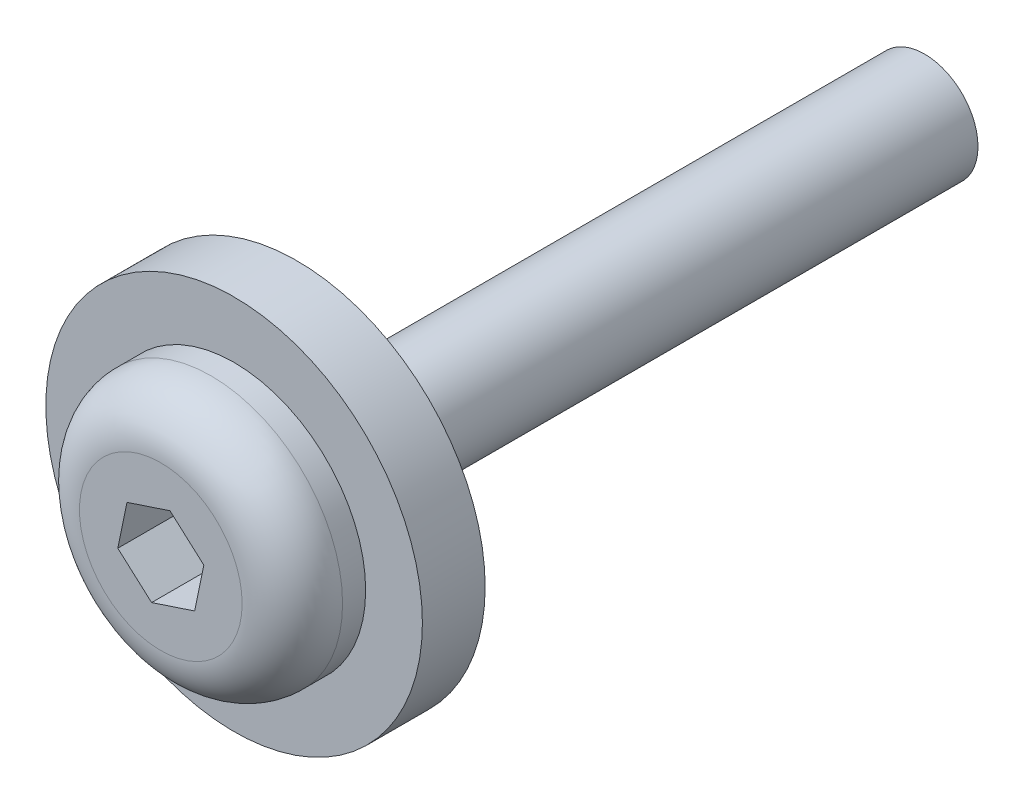
ISO-10303-21;
HEADER;
FILE_DESCRIPTION(('STEP AP214'),'2;1');
FILE_NAME('part.step','',(''),(''),'','','');
FILE_SCHEMA(('AUTOMOTIVE_DESIGN { 1 0 10303 214 1 1 1 1 }'));
ENDSEC;
DATA;
#1=APPLICATION_CONTEXT('core data for automotive mechanical design processes');
#2=APPLICATION_PROTOCOL_DEFINITION('international standard','automotive_design',2000,#1);
#3=PRODUCT_CONTEXT('',#1,'mechanical');
#4=PRODUCT('Part','Part','',(#3));
#5=PRODUCT_RELATED_PRODUCT_CATEGORY('part','',(#4));
#6=PRODUCT_DEFINITION_FORMATION('','',#4);
#7=PRODUCT_DEFINITION_CONTEXT('part definition',#1,'design');
#8=PRODUCT_DEFINITION('design','',#6,#7);
#9=PRODUCT_DEFINITION_SHAPE('','',#8);
#10=(LENGTH_UNIT() NAMED_UNIT(*) SI_UNIT(.MILLI.,.METRE.));
#11=(NAMED_UNIT(*) PLANE_ANGLE_UNIT() SI_UNIT($,.RADIAN.));
#12=(NAMED_UNIT(*) SI_UNIT($,.STERADIAN.) SOLID_ANGLE_UNIT());
#13=UNCERTAINTY_MEASURE_WITH_UNIT(LENGTH_MEASURE(1.E-05),#10,'distance_accuracy_value','');
#14=(GEOMETRIC_REPRESENTATION_CONTEXT(3) GLOBAL_UNCERTAINTY_ASSIGNED_CONTEXT((#13)) GLOBAL_UNIT_ASSIGNED_CONTEXT((#10,
#11,#12)) REPRESENTATION_CONTEXT('',''));
#15=CARTESIAN_POINT('',(0.,0.,0.));
#16=DIRECTION('',(0.,0.,1.));
#17=DIRECTION('',(1.,0.,0.));
#18=AXIS2_PLACEMENT_3D('',#15,#16,#17);
#19=CARTESIAN_POINT('',(0.,0.,15.875));
#20=DIRECTION('',(0.,0.,-1.));
#21=DIRECTION('',(-1.,0.,0.));
#22=AXIS2_PLACEMENT_3D('',#19,#20,#21);
#23=CYLINDRICAL_SURFACE('',#22,1.35255);
#24=CARTESIAN_POINT('',(0.,0.,15.875));
#25=DIRECTION('',(0.,0.,1.));
#26=DIRECTION('',(1.,0.,0.));
#27=AXIS2_PLACEMENT_3D('',#24,#25,#26);
#28=CIRCLE('',#27,1.35255);
#29=CARTESIAN_POINT('',(1.35255,0.,15.875));
#30=VERTEX_POINT('',#29);
#31=EDGE_CURVE('E150',#30,#30,#28,.T.);
#32=ORIENTED_EDGE('',*,*,#31,.F.);
#33=EDGE_LOOP('',(#32));
#34=FACE_BOUND('',#33,.T.);
#35=CARTESIAN_POINT('',(0.,0.,0.));
#36=DIRECTION('',(0.,0.,1.));
#37=DIRECTION('',(1.,0.,0.));
#38=AXIS2_PLACEMENT_3D('',#35,#36,#37);
#39=CIRCLE('',#38,1.35255);
#40=CARTESIAN_POINT('',(1.35255,0.,0.));
#41=VERTEX_POINT('',#40);
#42=EDGE_CURVE('E154',#41,#41,#39,.T.);
#43=ORIENTED_EDGE('',*,*,#42,.T.);
#44=EDGE_LOOP('',(#43));
#45=FACE_BOUND('',#44,.T.);
#46=ADVANCED_FACE('F39',(#34,#45),#23,.T.);
#47=CARTESIAN_POINT('',(0.,0.,0.));
#48=DIRECTION('',(0.,0.,1.));
#49=DIRECTION('',(1.,0.,0.));
#50=AXIS2_PLACEMENT_3D('',#47,#48,#49);
#51=PLANE('',#50);
#52=ORIENTED_EDGE('',*,*,#42,.F.);
#53=EDGE_LOOP('',(#52));
#54=FACE_BOUND('',#53,.T.);
#55=ADVANCED_FACE('F179',(#54),#51,.F.);
#56=CARTESIAN_POINT('',(0.,0.,17.4625));
#57=DIRECTION('',(0.,0.,-1.));
#58=DIRECTION('',(-1.,0.,0.));
#59=AXIS2_PLACEMENT_3D('',#56,#57,#58);
#60=CYLINDRICAL_SURFACE('',#59,4.7625);
#61=CARTESIAN_POINT('',(0.,0.,17.4625));
#62=DIRECTION('',(0.,0.,1.));
#63=DIRECTION('',(1.,0.,0.));
#64=AXIS2_PLACEMENT_3D('',#61,#62,#63);
#65=CIRCLE('',#64,4.7625);
#66=CARTESIAN_POINT('',(4.7625,0.,17.4625));
#67=VERTEX_POINT('',#66);
#68=EDGE_CURVE('E151',#67,#67,#65,.T.);
#69=ORIENTED_EDGE('',*,*,#68,.F.);
#70=EDGE_LOOP('',(#69));
#71=FACE_BOUND('',#70,.T.);
#72=CARTESIAN_POINT('',(0.,0.,15.875));
#73=DIRECTION('',(0.,0.,1.));
#74=DIRECTION('',(1.,0.,0.));
#75=AXIS2_PLACEMENT_3D('',#72,#73,#74);
#76=CIRCLE('',#75,4.7625);
#77=CARTESIAN_POINT('',(4.7625,0.,15.875));
#78=VERTEX_POINT('',#77);
#79=EDGE_CURVE('E141',#78,#78,#76,.T.);
#80=ORIENTED_EDGE('',*,*,#79,.T.);
#81=EDGE_LOOP('',(#80));
#82=FACE_BOUND('',#81,.T.);
#83=ADVANCED_FACE('F184',(#71,#82),#60,.T.);
#84=CARTESIAN_POINT('',(0.,0.,17.4625));
#85=DIRECTION('',(0.,0.,1.));
#86=DIRECTION('',(1.,0.,0.));
#87=AXIS2_PLACEMENT_3D('',#84,#85,#86);
#88=PLANE('',#87);
#89=CARTESIAN_POINT('',(0.,0.,17.4625));
#90=DIRECTION('',(0.,0.,1.));
#91=DIRECTION('',(1.,0.,0.));
#92=AXIS2_PLACEMENT_3D('',#89,#90,#91);
#93=CIRCLE('',#92,3.3274);
#94=CARTESIAN_POINT('',(3.3274,0.,17.4625));
#95=VERTEX_POINT('',#94);
#96=EDGE_CURVE('E147',#95,#95,#93,.T.);
#97=ORIENTED_EDGE('',*,*,#96,.F.);
#98=EDGE_LOOP('',(#97));
#99=FACE_BOUND('',#98,.T.);
#100=ORIENTED_EDGE('',*,*,#68,.T.);
#101=EDGE_LOOP('',(#100));
#102=FACE_BOUND('',#101,.T.);
#103=ADVANCED_FACE('F192',(#99,#102),#88,.T.);
#104=CARTESIAN_POINT('',(0.,0.,15.875));
#105=DIRECTION('',(0.,0.,1.));
#106=DIRECTION('',(1.,0.,0.));
#107=AXIS2_PLACEMENT_3D('',#104,#105,#106);
#108=PLANE('',#107);
#109=ORIENTED_EDGE('',*,*,#31,.T.);
#110=EDGE_LOOP('',(#109));
#111=FACE_BOUND('',#110,.T.);
#112=ORIENTED_EDGE('',*,*,#79,.F.);
#113=EDGE_LOOP('',(#112));
#114=FACE_BOUND('',#113,.T.);
#115=ADVANCED_FACE('F194',(#111,#114),#108,.F.);
#116=CARTESIAN_POINT('',(0.,0.,19.3167));
#117=DIRECTION('',(0.,0.,-1.));
#118=DIRECTION('',(-1.,0.,0.));
#119=AXIS2_PLACEMENT_3D('',#116,#117,#118);
#120=CYLINDRICAL_SURFACE('',#119,3.3274);
#121=CARTESIAN_POINT('',(0.,0.,18.0467));
#122=DIRECTION('',(0.,0.,1.));
#123=DIRECTION('',(1.,0.,0.));
#124=AXIS2_PLACEMENT_3D('',#121,#122,#123);
#125=CIRCLE('',#124,3.3274);
#126=CARTESIAN_POINT('',(3.3274,0.,18.0467));
#127=VERTEX_POINT('',#126);
#128=EDGE_CURVE('E11',#127,#127,#125,.F.);
#129=ORIENTED_EDGE('',*,*,#128,.T.);
#130=EDGE_LOOP('',(#129));
#131=FACE_BOUND('',#130,.T.);
#132=ORIENTED_EDGE('',*,*,#96,.T.);
#133=EDGE_LOOP('',(#132));
#134=FACE_BOUND('',#133,.T.);
#135=ADVANCED_FACE('F174',(#131,#134),#120,.T.);
#136=CARTESIAN_POINT('',(0.,0.,19.3167));
#137=DIRECTION('',(0.,0.,1.));
#138=DIRECTION('',(1.,0.,0.));
#139=AXIS2_PLACEMENT_3D('',#136,#137,#138);
#140=PLANE('',#139);
#141=DIRECTION('',(0.202959735100038,0.979187084232693,0.));
#142=VECTOR('',#141,1.);
#143=CARTESIAN_POINT('',(0.855273787268202,-0.76229136753622,19.3167));
#144=LINE('',#143,#142);
#145=CARTESIAN_POINT('',(0.855273787268202,-0.76229136753622,19.3167));
#146=VERTEX_POINT('',#145);
#147=CARTESIAN_POINT('',(1.08780058300605,0.359543143197081,19.3167));
#148=VERTEX_POINT('',#147);
#149=EDGE_CURVE('E54',#146,#148,#144,.T.);
#150=ORIENTED_EDGE('',*,*,#149,.F.);
#151=DIRECTION('',(0.949480757553144,0.313825255574353,0.));
#152=VECTOR('',#151,1.);
#153=CARTESIAN_POINT('',(-0.232526795737845,-1.1218345107333,19.3167));
#154=LINE('',#153,#152);
#155=CARTESIAN_POINT('',(-0.232526795737845,-1.1218345107333,19.3167));
#156=VERTEX_POINT('',#155);
#157=EDGE_CURVE('E137',#156,#146,#154,.T.);
#158=ORIENTED_EDGE('',*,*,#157,.F.);
#159=DIRECTION('',(0.746521022453106,-0.66536182865834,0.));
#160=VECTOR('',#159,1.);
#161=CARTESIAN_POINT('',(-1.08780058300605,-0.359543143197081,19.3167));
#162=LINE('',#161,#160);
#163=CARTESIAN_POINT('',(-1.08780058300605,-0.359543143197081,19.3167));
#164=VERTEX_POINT('',#163);
#165=EDGE_CURVE('E135',#164,#156,#162,.T.);
#166=ORIENTED_EDGE('',*,*,#165,.F.);
#167=DIRECTION('',(-0.202959735100038,-0.979187084232693,0.));
#168=VECTOR('',#167,1.);
#169=CARTESIAN_POINT('',(-0.855273787268202,0.762291367536219,19.3167));
#170=LINE('',#169,#168);
#171=CARTESIAN_POINT('',(-0.855273787268202,0.762291367536219,19.3167));
#172=VERTEX_POINT('',#171);
#173=EDGE_CURVE('E102',#172,#164,#170,.T.);
#174=ORIENTED_EDGE('',*,*,#173,.F.);
#175=DIRECTION('',(-0.949480757553144,-0.313825255574353,0.));
#176=VECTOR('',#175,1.);
#177=CARTESIAN_POINT('',(0.232526795737845,1.1218345107333,19.3167));
#178=LINE('',#177,#176);
#179=CARTESIAN_POINT('',(0.232526795737845,1.1218345107333,19.3167));
#180=VERTEX_POINT('',#179);
#181=EDGE_CURVE('E131',#180,#172,#178,.T.);
#182=ORIENTED_EDGE('',*,*,#181,.F.);
#183=DIRECTION('',(-0.746521022453106,0.66536182865834,0.));
#184=VECTOR('',#183,1.);
#185=CARTESIAN_POINT('',(1.08780058300605,0.359543143197081,19.3167));
#186=LINE('',#185,#184);
#187=EDGE_CURVE('E128',#148,#180,#186,.T.);
#188=ORIENTED_EDGE('',*,*,#187,.F.);
#189=EDGE_LOOP('',(#150,#158,#166,#174,#182,#188));
#190=FACE_BOUND('',#189,.T.);
#191=CARTESIAN_POINT('',(0.,0.,19.3167));
#192=DIRECTION('',(0.,0.,1.));
#193=DIRECTION('',(1.,0.,0.));
#194=AXIS2_PLACEMENT_3D('',#191,#192,#193);
#195=CIRCLE('',#194,2.0574);
#196=CARTESIAN_POINT('',(2.0574,0.,19.3167));
#197=VERTEX_POINT('',#196);
#198=EDGE_CURVE('E47',#197,#197,#195,.T.);
#199=ORIENTED_EDGE('',*,*,#198,.T.);
#200=EDGE_LOOP('',(#199));
#201=FACE_BOUND('',#200,.T.);
#202=ADVANCED_FACE('F163',(#190,#201),#140,.T.);
#203=CARTESIAN_POINT('',(0.,0.,18.0467));
#204=DIRECTION('',(0.,0.,1.));
#205=DIRECTION('',(1.,0.,0.));
#206=AXIS2_PLACEMENT_3D('',#203,#204,#205);
#207=TOROIDAL_SURFACE('',#206,2.0574,1.27);
#208=ORIENTED_EDGE('',*,*,#128,.F.);
#209=EDGE_LOOP('',(#208));
#210=FACE_BOUND('',#209,.T.);
#211=ORIENTED_EDGE('',*,*,#198,.F.);
#212=EDGE_LOOP('',(#211));
#213=FACE_BOUND('',#212,.T.);
#214=ADVANCED_FACE('F41',(#210,#213),#207,.T.);
#215=CARTESIAN_POINT('',(0.855273787268202,-0.76229136753622,17.4625));
#216=DIRECTION('',(0.979187084232693,-0.202959735100038,0.));
#217=DIRECTION('',(0.202959735100038,0.979187084232693,0.));
#218=AXIS2_PLACEMENT_3D('',#215,#216,#217);
#219=PLANE('',#218);
#220=ORIENTED_EDGE('',*,*,#149,.T.);
#221=DIRECTION('',(0.,0.,1.));
#222=VECTOR('',#221,1.);
#223=CARTESIAN_POINT('',(1.08780058300605,0.359543143197081,17.4625));
#224=LINE('',#223,#222);
#225=CARTESIAN_POINT('',(1.08780058300605,0.359543143197081,17.4625));
#226=VERTEX_POINT('',#225);
#227=EDGE_CURVE('E84',#226,#148,#224,.T.);
#228=ORIENTED_EDGE('',*,*,#227,.F.);
#229=DIRECTION('',(0.202959735100038,0.979187084232693,0.));
#230=VECTOR('',#229,1.);
#231=CARTESIAN_POINT('',(0.855273787268202,-0.76229136753622,17.4625));
#232=LINE('',#231,#230);
#233=CARTESIAN_POINT('',(0.855273787268202,-0.76229136753622,17.4625));
#234=VERTEX_POINT('',#233);
#235=EDGE_CURVE('E139',#234,#226,#232,.T.);
#236=ORIENTED_EDGE('',*,*,#235,.F.);
#237=DIRECTION('',(0.,0.,1.));
#238=VECTOR('',#237,1.);
#239=CARTESIAN_POINT('',(0.855273787268202,-0.76229136753622,17.4625));
#240=LINE('',#239,#238);
#241=EDGE_CURVE('E62',#234,#146,#240,.T.);
#242=ORIENTED_EDGE('',*,*,#241,.T.);
#243=EDGE_LOOP('',(#220,#228,#236,#242));
#244=FACE_BOUND('',#243,.T.);
#245=ADVANCED_FACE('F166',(#244),#219,.F.);
#246=CARTESIAN_POINT('',(-0.232526795737845,-1.1218345107333,17.4625));
#247=DIRECTION('',(0.313825255574353,-0.949480757553144,0.));
#248=DIRECTION('',(0.949480757553144,0.313825255574353,0.));
#249=AXIS2_PLACEMENT_3D('',#246,#247,#248);
#250=PLANE('',#249);
#251=ORIENTED_EDGE('',*,*,#157,.T.);
#252=ORIENTED_EDGE('',*,*,#241,.F.);
#253=DIRECTION('',(0.949480757553144,0.313825255574353,0.));
#254=VECTOR('',#253,1.);
#255=CARTESIAN_POINT('',(-0.232526795737845,-1.1218345107333,17.4625));
#256=LINE('',#255,#254);
#257=CARTESIAN_POINT('',(-0.232526795737845,-1.1218345107333,17.4625));
#258=VERTEX_POINT('',#257);
#259=EDGE_CURVE('E114',#258,#234,#256,.T.);
#260=ORIENTED_EDGE('',*,*,#259,.F.);
#261=DIRECTION('',(0.,0.,1.));
#262=VECTOR('',#261,1.);
#263=CARTESIAN_POINT('',(-0.232526795737845,-1.1218345107333,17.4625));
#264=LINE('',#263,#262);
#265=EDGE_CURVE('E106',#258,#156,#264,.T.);
#266=ORIENTED_EDGE('',*,*,#265,.T.);
#267=EDGE_LOOP('',(#251,#252,#260,#266));
#268=FACE_BOUND('',#267,.T.);
#269=ADVANCED_FACE('F172',(#268),#250,.F.);
#270=CARTESIAN_POINT('',(-1.08780058300605,-0.359543143197081,17.4625));
#271=DIRECTION('',(-0.66536182865834,-0.746521022453106,0.));
#272=DIRECTION('',(0.746521022453106,-0.66536182865834,0.));
#273=AXIS2_PLACEMENT_3D('',#270,#271,#272);
#274=PLANE('',#273);
#275=ORIENTED_EDGE('',*,*,#165,.T.);
#276=ORIENTED_EDGE('',*,*,#265,.F.);
#277=DIRECTION('',(0.746521022453106,-0.66536182865834,0.));
#278=VECTOR('',#277,1.);
#279=CARTESIAN_POINT('',(-1.08780058300605,-0.359543143197081,17.4625));
#280=LINE('',#279,#278);
#281=CARTESIAN_POINT('',(-1.08780058300605,-0.359543143197081,17.4625));
#282=VERTEX_POINT('',#281);
#283=EDGE_CURVE('E110',#282,#258,#280,.T.);
#284=ORIENTED_EDGE('',*,*,#283,.F.);
#285=DIRECTION('',(0.,0.,1.));
#286=VECTOR('',#285,1.);
#287=CARTESIAN_POINT('',(-1.08780058300605,-0.359543143197081,17.4625));
#288=LINE('',#287,#286);
#289=EDGE_CURVE('E95',#282,#164,#288,.T.);
#290=ORIENTED_EDGE('',*,*,#289,.T.);
#291=EDGE_LOOP('',(#275,#276,#284,#290));
#292=FACE_BOUND('',#291,.T.);
#293=ADVANCED_FACE('F111',(#292),#274,.F.);
#294=CARTESIAN_POINT('',(-0.855273787268202,0.762291367536219,17.4625));
#295=DIRECTION('',(-0.979187084232693,0.202959735100038,0.));
#296=DIRECTION('',(-0.202959735100038,-0.979187084232693,0.));
#297=AXIS2_PLACEMENT_3D('',#294,#295,#296);
#298=PLANE('',#297);
#299=ORIENTED_EDGE('',*,*,#173,.T.);
#300=ORIENTED_EDGE('',*,*,#289,.F.);
#301=DIRECTION('',(-0.202959735100038,-0.979187084232693,0.));
#302=VECTOR('',#301,1.);
#303=CARTESIAN_POINT('',(-0.855273787268202,0.762291367536219,17.4625));
#304=LINE('',#303,#302);
#305=CARTESIAN_POINT('',(-0.855273787268202,0.762291367536219,17.4625));
#306=VERTEX_POINT('',#305);
#307=EDGE_CURVE('E99',#306,#282,#304,.T.);
#308=ORIENTED_EDGE('',*,*,#307,.F.);
#309=DIRECTION('',(0.,0.,1.));
#310=VECTOR('',#309,1.);
#311=CARTESIAN_POINT('',(-0.855273787268202,0.762291367536219,17.4625));
#312=LINE('',#311,#310);
#313=EDGE_CURVE('E107',#306,#172,#312,.T.);
#314=ORIENTED_EDGE('',*,*,#313,.T.);
#315=EDGE_LOOP('',(#299,#300,#308,#314));
#316=FACE_BOUND('',#315,.T.);
#317=ADVANCED_FACE('F97',(#316),#298,.F.);
#318=CARTESIAN_POINT('',(0.232526795737845,1.1218345107333,17.4625));
#319=DIRECTION('',(-0.313825255574353,0.949480757553144,0.));
#320=DIRECTION('',(-0.949480757553144,-0.313825255574353,0.));
#321=AXIS2_PLACEMENT_3D('',#318,#319,#320);
#322=PLANE('',#321);
#323=ORIENTED_EDGE('',*,*,#181,.T.);
#324=ORIENTED_EDGE('',*,*,#313,.F.);
#325=DIRECTION('',(-0.949480757553144,-0.313825255574353,0.));
#326=VECTOR('',#325,1.);
#327=CARTESIAN_POINT('',(0.232526795737845,1.1218345107333,17.4625));
#328=LINE('',#327,#326);
#329=CARTESIAN_POINT('',(0.232526795737845,1.1218345107333,17.4625));
#330=VERTEX_POINT('',#329);
#331=EDGE_CURVE('E120',#330,#306,#328,.T.);
#332=ORIENTED_EDGE('',*,*,#331,.F.);
#333=DIRECTION('',(0.,0.,1.));
#334=VECTOR('',#333,1.);
#335=CARTESIAN_POINT('',(0.232526795737845,1.1218345107333,17.4625));
#336=LINE('',#335,#334);
#337=EDGE_CURVE('E144',#330,#180,#336,.T.);
#338=ORIENTED_EDGE('',*,*,#337,.T.);
#339=EDGE_LOOP('',(#323,#324,#332,#338));
#340=FACE_BOUND('',#339,.T.);
#341=ADVANCED_FACE('F207',(#340),#322,.F.);
#342=CARTESIAN_POINT('',(1.08780058300605,0.359543143197081,17.4625));
#343=DIRECTION('',(0.66536182865834,0.746521022453106,0.));
#344=DIRECTION('',(-0.746521022453106,0.66536182865834,0.));
#345=AXIS2_PLACEMENT_3D('',#342,#343,#344);
#346=PLANE('',#345);
#347=ORIENTED_EDGE('',*,*,#187,.T.);
#348=ORIENTED_EDGE('',*,*,#337,.F.);
#349=DIRECTION('',(-0.746521022453106,0.66536182865834,0.));
#350=VECTOR('',#349,1.);
#351=CARTESIAN_POINT('',(1.08780058300605,0.359543143197081,17.4625));
#352=LINE('',#351,#350);
#353=EDGE_CURVE('E122',#226,#330,#352,.T.);
#354=ORIENTED_EDGE('',*,*,#353,.F.);
#355=ORIENTED_EDGE('',*,*,#227,.T.);
#356=EDGE_LOOP('',(#347,#348,#354,#355));
#357=FACE_BOUND('',#356,.T.);
#358=ADVANCED_FACE('F204',(#357),#346,.F.);
#359=CARTESIAN_POINT('',(0.,0.,17.4625));
#360=DIRECTION('',(0.,0.,1.));
#361=DIRECTION('',(1.,0.,0.));
#362=AXIS2_PLACEMENT_3D('',#359,#360,#361);
#363=PLANE('',#362);
#364=ORIENTED_EDGE('',*,*,#235,.T.);
#365=ORIENTED_EDGE('',*,*,#353,.T.);
#366=ORIENTED_EDGE('',*,*,#331,.T.);
#367=ORIENTED_EDGE('',*,*,#307,.T.);
#368=ORIENTED_EDGE('',*,*,#283,.T.);
#369=ORIENTED_EDGE('',*,*,#259,.T.);
#370=EDGE_LOOP('',(#364,#365,#366,#367,#368,#369));
#371=FACE_BOUND('',#370,.T.);
#372=ADVANCED_FACE('F117',(#371),#363,.T.);
#373=CLOSED_SHELL('',(#46,#55,#83,#103,#115,#135,#202,#214,#245,#269,#293,#317,#341,#358,#372));
#374=MANIFOLD_SOLID_BREP('B2',#373);
#375=ADVANCED_BREP_SHAPE_REPRESENTATION('',(#18,#374),#14);
#376=SHAPE_DEFINITION_REPRESENTATION(#9,#375);
ENDSEC;
END-ISO-10303-21;
